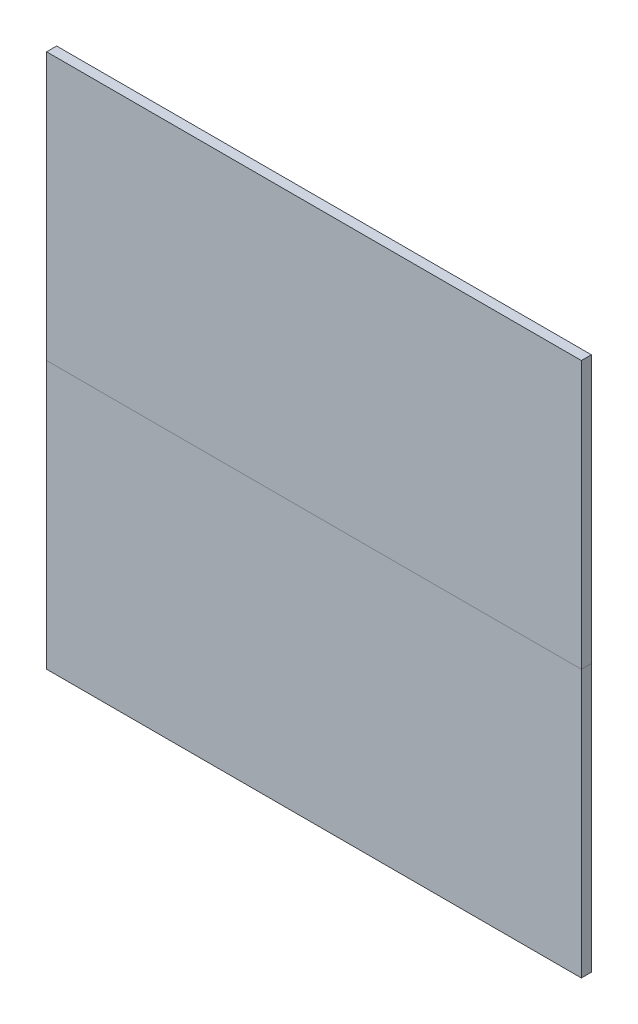
ISO-10303-21;
HEADER;
FILE_DESCRIPTION(('STEP AP214'),'2;1');
FILE_NAME('part.step','',(''),(''),'','','');
FILE_SCHEMA(('AUTOMOTIVE_DESIGN { 1 0 10303 214 1 1 1 1 }'));
ENDSEC;
DATA;
#1=APPLICATION_CONTEXT('core data for automotive mechanical design processes');
#2=APPLICATION_PROTOCOL_DEFINITION('international standard','automotive_design',2000,#1);
#3=PRODUCT_CONTEXT('',#1,'mechanical');
#4=PRODUCT('Part','Part','',(#3));
#5=PRODUCT_RELATED_PRODUCT_CATEGORY('part','',(#4));
#6=PRODUCT_DEFINITION_FORMATION('','',#4);
#7=PRODUCT_DEFINITION_CONTEXT('part definition',#1,'design');
#8=PRODUCT_DEFINITION('design','',#6,#7);
#9=PRODUCT_DEFINITION_SHAPE('','',#8);
#10=(LENGTH_UNIT() NAMED_UNIT(*) SI_UNIT(.MILLI.,.METRE.));
#11=(NAMED_UNIT(*) PLANE_ANGLE_UNIT() SI_UNIT($,.RADIAN.));
#12=(NAMED_UNIT(*) SI_UNIT($,.STERADIAN.) SOLID_ANGLE_UNIT());
#13=UNCERTAINTY_MEASURE_WITH_UNIT(LENGTH_MEASURE(1.E-05),#10,'distance_accuracy_value','');
#14=(GEOMETRIC_REPRESENTATION_CONTEXT(3) GLOBAL_UNCERTAINTY_ASSIGNED_CONTEXT((#13)) GLOBAL_UNIT_ASSIGNED_CONTEXT((#10,
#11,#12)) REPRESENTATION_CONTEXT('',''));
#15=CARTESIAN_POINT('',(0.,0.,0.));
#16=DIRECTION('',(0.,0.,1.));
#17=DIRECTION('',(1.,0.,0.));
#18=AXIS2_PLACEMENT_3D('',#15,#16,#17);
#19=CARTESIAN_POINT('',(0.,0.,0.));
#20=DIRECTION('',(0.,0.,-1.));
#21=DIRECTION('',(-1.,0.,0.));
#22=AXIS2_PLACEMENT_3D('',#19,#20,#21);
#23=PLANE('',#22);
#24=DIRECTION('',(0.,-1.,0.));
#25=VECTOR('',#24,1.);
#26=CARTESIAN_POINT('',(0.,8.,0.));
#27=LINE('',#26,#25);
#28=CARTESIAN_POINT('',(0.,16.,0.));
#29=VERTEX_POINT('',#28);
#30=CARTESIAN_POINT('',(0.,8.,0.));
#31=VERTEX_POINT('',#30);
#32=EDGE_CURVE('E52',#29,#31,#27,.T.);
#33=ORIENTED_EDGE('',*,*,#32,.F.);
#34=DIRECTION('',(-1.,0.,0.));
#35=VECTOR('',#34,1.);
#36=CARTESIAN_POINT('',(0.,16.,0.));
#37=LINE('',#36,#35);
#38=CARTESIAN_POINT('',(16.,16.,0.));
#39=VERTEX_POINT('',#38);
#40=EDGE_CURVE('E75',#39,#29,#37,.T.);
#41=ORIENTED_EDGE('',*,*,#40,.F.);
#42=DIRECTION('',(0.,1.,0.));
#43=VECTOR('',#42,1.);
#44=CARTESIAN_POINT('',(16.,8.,0.));
#45=LINE('',#44,#43);
#46=CARTESIAN_POINT('',(16.,8.,0.));
#47=VERTEX_POINT('',#46);
#48=EDGE_CURVE('E80',#47,#39,#45,.T.);
#49=ORIENTED_EDGE('',*,*,#48,.F.);
#50=DIRECTION('',(1.,0.,0.));
#51=VECTOR('',#50,1.);
#52=CARTESIAN_POINT('',(0.,8.,0.));
#53=LINE('',#52,#51);
#54=EDGE_CURVE('E95',#31,#47,#53,.T.);
#55=ORIENTED_EDGE('',*,*,#54,.F.);
#56=EDGE_LOOP('',(#33,#41,#49,#55));
#57=FACE_BOUND('',#56,.T.);
#58=ADVANCED_FACE('F44',(#57),#23,.T.);
#59=CARTESIAN_POINT('',(0.,0.,0.3));
#60=DIRECTION('',(0.,0.,-1.));
#61=DIRECTION('',(-1.,0.,0.));
#62=AXIS2_PLACEMENT_3D('',#59,#60,#61);
#63=PLANE('',#62);
#64=DIRECTION('',(0.,-1.,0.));
#65=VECTOR('',#64,1.);
#66=CARTESIAN_POINT('',(0.,8.,0.3));
#67=LINE('',#66,#65);
#68=CARTESIAN_POINT('',(0.,16.,0.3));
#69=VERTEX_POINT('',#68);
#70=CARTESIAN_POINT('',(0.,8.,0.3));
#71=VERTEX_POINT('',#70);
#72=EDGE_CURVE('E104',#69,#71,#67,.T.);
#73=ORIENTED_EDGE('',*,*,#72,.T.);
#74=DIRECTION('',(1.,0.,0.));
#75=VECTOR('',#74,1.);
#76=CARTESIAN_POINT('',(0.,8.,0.3));
#77=LINE('',#76,#75);
#78=CARTESIAN_POINT('',(16.,8.,0.3));
#79=VERTEX_POINT('',#78);
#80=EDGE_CURVE('E93',#71,#79,#77,.T.);
#81=ORIENTED_EDGE('',*,*,#80,.T.);
#82=DIRECTION('',(0.,1.,0.));
#83=VECTOR('',#82,1.);
#84=CARTESIAN_POINT('',(16.,8.,0.3));
#85=LINE('',#84,#83);
#86=CARTESIAN_POINT('',(16.,16.,0.3));
#87=VERTEX_POINT('',#86);
#88=EDGE_CURVE('E96',#79,#87,#85,.T.);
#89=ORIENTED_EDGE('',*,*,#88,.T.);
#90=DIRECTION('',(-1.,0.,0.));
#91=VECTOR('',#90,1.);
#92=CARTESIAN_POINT('',(0.,16.,0.3));
#93=LINE('',#92,#91);
#94=EDGE_CURVE('E101',#87,#69,#93,.T.);
#95=ORIENTED_EDGE('',*,*,#94,.T.);
#96=EDGE_LOOP('',(#73,#81,#89,#95));
#97=FACE_BOUND('',#96,.T.);
#98=ADVANCED_FACE('F103',(#97),#63,.F.);
#99=CARTESIAN_POINT('',(0.,8.,-17.8885438199983));
#100=DIRECTION('',(0.,-1.,0.));
#101=DIRECTION('',(0.,0.,-1.));
#102=AXIS2_PLACEMENT_3D('',#99,#100,#101);
#103=PLANE('',#102);
#104=DIRECTION('',(0.,0.,1.));
#105=VECTOR('',#104,1.);
#106=CARTESIAN_POINT('',(0.,8.,-17.8885438199983));
#107=LINE('',#106,#105);
#108=EDGE_CURVE('E12',#31,#71,#107,.T.);
#109=ORIENTED_EDGE('',*,*,#108,.F.);
#110=ORIENTED_EDGE('',*,*,#54,.T.);
#111=DIRECTION('',(0.,0.,1.));
#112=VECTOR('',#111,1.);
#113=CARTESIAN_POINT('',(16.,8.,-17.8885438199983));
#114=LINE('',#113,#112);
#115=EDGE_CURVE('E90',#47,#79,#114,.T.);
#116=ORIENTED_EDGE('',*,*,#115,.T.);
#117=ORIENTED_EDGE('',*,*,#80,.F.);
#118=EDGE_LOOP('',(#109,#110,#116,#117));
#119=FACE_BOUND('',#118,.T.);
#120=ADVANCED_FACE('F91',(#119),#103,.T.);
#121=CARTESIAN_POINT('',(16.,8.,-17.8885438199983));
#122=DIRECTION('',(1.,0.,0.));
#123=DIRECTION('',(0.,0.,-1.));
#124=AXIS2_PLACEMENT_3D('',#121,#122,#123);
#125=PLANE('',#124);
#126=ORIENTED_EDGE('',*,*,#115,.F.);
#127=ORIENTED_EDGE('',*,*,#48,.T.);
#128=DIRECTION('',(0.,0.,1.));
#129=VECTOR('',#128,1.);
#130=CARTESIAN_POINT('',(16.,16.,-17.8885438199983));
#131=LINE('',#130,#129);
#132=EDGE_CURVE('E85',#39,#87,#131,.T.);
#133=ORIENTED_EDGE('',*,*,#132,.T.);
#134=ORIENTED_EDGE('',*,*,#88,.F.);
#135=EDGE_LOOP('',(#126,#127,#133,#134));
#136=FACE_BOUND('',#135,.T.);
#137=ADVANCED_FACE('F97',(#136),#125,.T.);
#138=CARTESIAN_POINT('',(0.,16.,-17.8885438199983));
#139=DIRECTION('',(0.,1.,0.));
#140=DIRECTION('',(0.,0.,1.));
#141=AXIS2_PLACEMENT_3D('',#138,#139,#140);
#142=PLANE('',#141);
#143=ORIENTED_EDGE('',*,*,#132,.F.);
#144=ORIENTED_EDGE('',*,*,#40,.T.);
#145=DIRECTION('',(0.,0.,1.));
#146=VECTOR('',#145,1.);
#147=CARTESIAN_POINT('',(0.,16.,-17.8885438199983));
#148=LINE('',#147,#146);
#149=EDGE_CURVE('E111',#29,#69,#148,.T.);
#150=ORIENTED_EDGE('',*,*,#149,.T.);
#151=ORIENTED_EDGE('',*,*,#94,.F.);
#152=EDGE_LOOP('',(#143,#144,#150,#151));
#153=FACE_BOUND('',#152,.T.);
#154=ADVANCED_FACE('F117',(#153),#142,.T.);
#155=CARTESIAN_POINT('',(0.,8.,-17.8885438199983));
#156=DIRECTION('',(-1.,0.,0.));
#157=DIRECTION('',(0.,0.,1.));
#158=AXIS2_PLACEMENT_3D('',#155,#156,#157);
#159=PLANE('',#158);
#160=ORIENTED_EDGE('',*,*,#149,.F.);
#161=ORIENTED_EDGE('',*,*,#32,.T.);
#162=ORIENTED_EDGE('',*,*,#108,.T.);
#163=ORIENTED_EDGE('',*,*,#72,.F.);
#164=EDGE_LOOP('',(#160,#161,#162,#163));
#165=FACE_BOUND('',#164,.T.);
#166=ADVANCED_FACE('F118',(#165),#159,.T.);
#167=CLOSED_SHELL('',(#58,#98,#120,#137,#154,#166));
#168=MANIFOLD_SOLID_BREP('B2',#167);
#169=CARTESIAN_POINT('',(0.,0.,0.3));
#170=DIRECTION('',(1.,0.,0.));
#171=DIRECTION('',(0.,0.,-1.));
#172=AXIS2_PLACEMENT_3D('',#169,#170,#171);
#173=PLANE('',#172);
#174=DIRECTION('',(0.,-1.,0.));
#175=VECTOR('',#174,1.);
#176=CARTESIAN_POINT('',(0.,0.,0.));
#177=LINE('',#176,#175);
#178=CARTESIAN_POINT('',(0.,8.,0.));
#179=VERTEX_POINT('',#178);
#180=CARTESIAN_POINT('',(0.,0.,0.));
#181=VERTEX_POINT('',#180);
#182=EDGE_CURVE('E230',#179,#181,#177,.T.);
#183=ORIENTED_EDGE('',*,*,#182,.T.);
#184=DIRECTION('',(0.,0.,-1.));
#185=VECTOR('',#184,1.);
#186=CARTESIAN_POINT('',(0.,0.,0.3));
#187=LINE('',#186,#185);
#188=CARTESIAN_POINT('',(0.,0.,0.3));
#189=VERTEX_POINT('',#188);
#190=EDGE_CURVE('E42',#189,#181,#187,.T.);
#191=ORIENTED_EDGE('',*,*,#190,.F.);
#192=DIRECTION('',(0.,-1.,0.));
#193=VECTOR('',#192,1.);
#194=CARTESIAN_POINT('',(0.,0.,0.3));
#195=LINE('',#194,#193);
#196=CARTESIAN_POINT('',(0.,8.,0.3));
#197=VERTEX_POINT('',#196);
#198=EDGE_CURVE('E218',#197,#189,#195,.T.);
#199=ORIENTED_EDGE('',*,*,#198,.F.);
#200=DIRECTION('',(0.,0.,-1.));
#201=VECTOR('',#200,1.);
#202=CARTESIAN_POINT('',(0.,8.,0.3));
#203=LINE('',#202,#201);
#204=EDGE_CURVE('E226',#197,#179,#203,.T.);
#205=ORIENTED_EDGE('',*,*,#204,.T.);
#206=EDGE_LOOP('',(#183,#191,#199,#205));
#207=FACE_BOUND('',#206,.T.);
#208=ADVANCED_FACE('F167',(#207),#173,.F.);
#209=CARTESIAN_POINT('',(0.,0.,0.3));
#210=DIRECTION('',(0.,1.,0.));
#211=DIRECTION('',(0.,0.,1.));
#212=AXIS2_PLACEMENT_3D('',#209,#210,#211);
#213=PLANE('',#212);
#214=DIRECTION('',(1.,0.,0.));
#215=VECTOR('',#214,1.);
#216=CARTESIAN_POINT('',(0.,0.,0.));
#217=LINE('',#216,#215);
#218=CARTESIAN_POINT('',(16.,0.,0.));
#219=VERTEX_POINT('',#218);
#220=EDGE_CURVE('E222',#181,#219,#217,.T.);
#221=ORIENTED_EDGE('',*,*,#220,.T.);
#222=DIRECTION('',(0.,0.,-1.));
#223=VECTOR('',#222,1.);
#224=CARTESIAN_POINT('',(16.,0.,0.3));
#225=LINE('',#224,#223);
#226=CARTESIAN_POINT('',(16.,0.,0.3));
#227=VERTEX_POINT('',#226);
#228=EDGE_CURVE('E175',#227,#219,#225,.T.);
#229=ORIENTED_EDGE('',*,*,#228,.F.);
#230=DIRECTION('',(1.,0.,0.));
#231=VECTOR('',#230,1.);
#232=CARTESIAN_POINT('',(0.,0.,0.3));
#233=LINE('',#232,#231);
#234=EDGE_CURVE('E213',#189,#227,#233,.T.);
#235=ORIENTED_EDGE('',*,*,#234,.F.);
#236=ORIENTED_EDGE('',*,*,#190,.T.);
#237=EDGE_LOOP('',(#221,#229,#235,#236));
#238=FACE_BOUND('',#237,.T.);
#239=ADVANCED_FACE('F221',(#238),#213,.F.);
#240=CARTESIAN_POINT('',(16.,0.,0.3));
#241=DIRECTION('',(-1.,0.,0.));
#242=DIRECTION('',(0.,0.,1.));
#243=AXIS2_PLACEMENT_3D('',#240,#241,#242);
#244=PLANE('',#243);
#245=DIRECTION('',(0.,1.,0.));
#246=VECTOR('',#245,1.);
#247=CARTESIAN_POINT('',(16.,0.,0.));
#248=LINE('',#247,#246);
#249=CARTESIAN_POINT('',(16.,8.,0.));
#250=VERTEX_POINT('',#249);
#251=EDGE_CURVE('E200',#219,#250,#248,.T.);
#252=ORIENTED_EDGE('',*,*,#251,.T.);
#253=DIRECTION('',(0.,0.,-1.));
#254=VECTOR('',#253,1.);
#255=CARTESIAN_POINT('',(16.,8.,0.3));
#256=LINE('',#255,#254);
#257=CARTESIAN_POINT('',(16.,8.,0.3));
#258=VERTEX_POINT('',#257);
#259=EDGE_CURVE('E223',#258,#250,#256,.T.);
#260=ORIENTED_EDGE('',*,*,#259,.F.);
#261=DIRECTION('',(0.,1.,0.));
#262=VECTOR('',#261,1.);
#263=CARTESIAN_POINT('',(16.,0.,0.3));
#264=LINE('',#263,#262);
#265=EDGE_CURVE('E216',#227,#258,#264,.T.);
#266=ORIENTED_EDGE('',*,*,#265,.F.);
#267=ORIENTED_EDGE('',*,*,#228,.T.);
#268=EDGE_LOOP('',(#252,#260,#266,#267));
#269=FACE_BOUND('',#268,.T.);
#270=ADVANCED_FACE('F224',(#269),#244,.F.);
#271=CARTESIAN_POINT('',(0.,8.,0.3));
#272=DIRECTION('',(0.,-1.,0.));
#273=DIRECTION('',(0.,0.,-1.));
#274=AXIS2_PLACEMENT_3D('',#271,#272,#273);
#275=PLANE('',#274);
#276=DIRECTION('',(-1.,0.,0.));
#277=VECTOR('',#276,1.);
#278=CARTESIAN_POINT('',(0.,8.,0.));
#279=LINE('',#278,#277);
#280=EDGE_CURVE('E206',#250,#179,#279,.T.);
#281=ORIENTED_EDGE('',*,*,#280,.T.);
#282=ORIENTED_EDGE('',*,*,#204,.F.);
#283=DIRECTION('',(-1.,0.,0.));
#284=VECTOR('',#283,1.);
#285=CARTESIAN_POINT('',(0.,8.,0.3));
#286=LINE('',#285,#284);
#287=EDGE_CURVE('E183',#258,#197,#286,.T.);
#288=ORIENTED_EDGE('',*,*,#287,.F.);
#289=ORIENTED_EDGE('',*,*,#259,.T.);
#290=EDGE_LOOP('',(#281,#282,#288,#289));
#291=FACE_BOUND('',#290,.T.);
#292=ADVANCED_FACE('F237',(#291),#275,.F.);
#293=CARTESIAN_POINT('',(0.,0.,0.3));
#294=DIRECTION('',(0.,0.,-1.));
#295=DIRECTION('',(-1.,0.,0.));
#296=AXIS2_PLACEMENT_3D('',#293,#294,#295);
#297=PLANE('',#296);
#298=ORIENTED_EDGE('',*,*,#198,.T.);
#299=ORIENTED_EDGE('',*,*,#234,.T.);
#300=ORIENTED_EDGE('',*,*,#265,.T.);
#301=ORIENTED_EDGE('',*,*,#287,.T.);
#302=EDGE_LOOP('',(#298,#299,#300,#301));
#303=FACE_BOUND('',#302,.T.);
#304=ADVANCED_FACE('F214',(#303),#297,.F.);
#305=CARTESIAN_POINT('',(0.,0.,0.));
#306=DIRECTION('',(0.,0.,-1.));
#307=DIRECTION('',(-1.,0.,0.));
#308=AXIS2_PLACEMENT_3D('',#305,#306,#307);
#309=PLANE('',#308);
#310=ORIENTED_EDGE('',*,*,#182,.F.);
#311=ORIENTED_EDGE('',*,*,#280,.F.);
#312=ORIENTED_EDGE('',*,*,#251,.F.);
#313=ORIENTED_EDGE('',*,*,#220,.F.);
#314=EDGE_LOOP('',(#310,#311,#312,#313));
#315=FACE_BOUND('',#314,.T.);
#316=ADVANCED_FACE('F240',(#315),#309,.T.);
#317=CLOSED_SHELL('',(#208,#239,#270,#292,#304,#316));
#318=MANIFOLD_SOLID_BREP('B6',#317);
#319=ADVANCED_BREP_SHAPE_REPRESENTATION('',(#18,#168,#318),#14);
#320=SHAPE_DEFINITION_REPRESENTATION(#9,#319);
ENDSEC;
END-ISO-10303-21;
